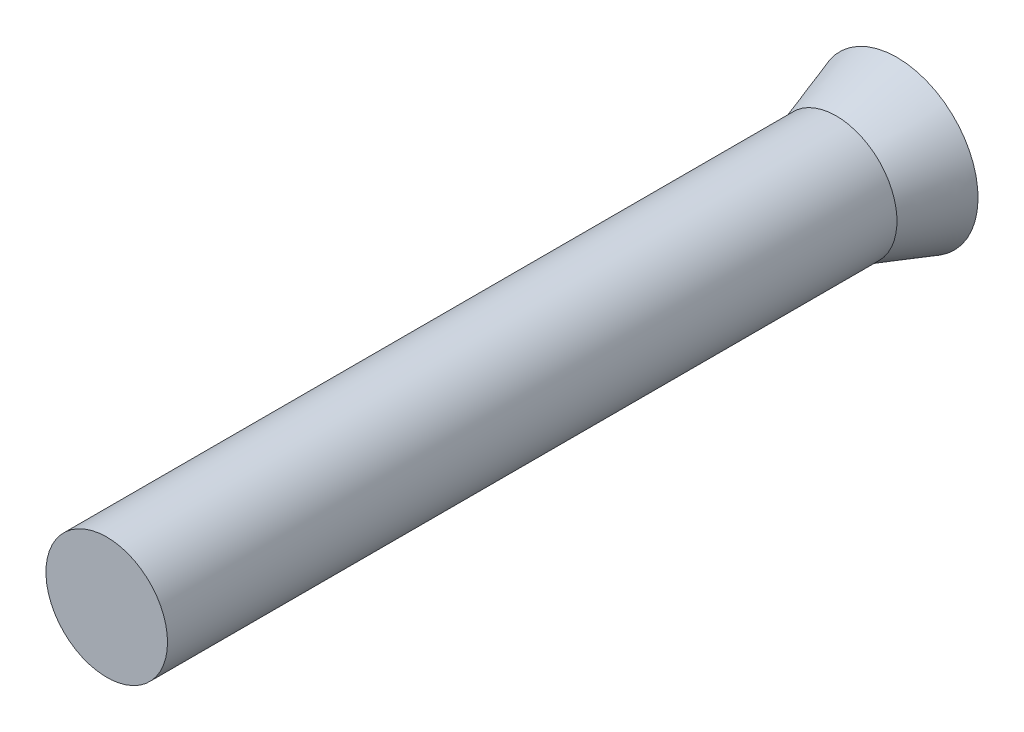
ISO-10303-21;
HEADER;
FILE_DESCRIPTION(('STEP AP214'),'2;1');
FILE_NAME('part.step','',(''),(''),'','','');
FILE_SCHEMA(('AUTOMOTIVE_DESIGN { 1 0 10303 214 1 1 1 1 }'));
ENDSEC;
DATA;
#1=APPLICATION_CONTEXT('core data for automotive mechanical design processes');
#2=APPLICATION_PROTOCOL_DEFINITION('international standard','automotive_design',2000,#1);
#3=PRODUCT_CONTEXT('',#1,'mechanical');
#4=PRODUCT('Part','Part','',(#3));
#5=PRODUCT_RELATED_PRODUCT_CATEGORY('part','',(#4));
#6=PRODUCT_DEFINITION_FORMATION('','',#4);
#7=PRODUCT_DEFINITION_CONTEXT('part definition',#1,'design');
#8=PRODUCT_DEFINITION('design','',#6,#7);
#9=PRODUCT_DEFINITION_SHAPE('','',#8);
#10=(LENGTH_UNIT() NAMED_UNIT(*) SI_UNIT(.MILLI.,.METRE.));
#11=(NAMED_UNIT(*) PLANE_ANGLE_UNIT() SI_UNIT($,.RADIAN.));
#12=(NAMED_UNIT(*) SI_UNIT($,.STERADIAN.) SOLID_ANGLE_UNIT());
#13=UNCERTAINTY_MEASURE_WITH_UNIT(LENGTH_MEASURE(1.E-05),#10,'distance_accuracy_value','');
#14=(GEOMETRIC_REPRESENTATION_CONTEXT(3) GLOBAL_UNCERTAINTY_ASSIGNED_CONTEXT((#13)) GLOBAL_UNIT_ASSIGNED_CONTEXT((#10,
#11,#12)) REPRESENTATION_CONTEXT('',''));
#15=CARTESIAN_POINT('',(0.,0.,0.));
#16=DIRECTION('',(0.,0.,1.));
#17=DIRECTION('',(1.,0.,0.));
#18=AXIS2_PLACEMENT_3D('',#15,#16,#17);
#19=CARTESIAN_POINT('',(0.,0.,18.));
#20=DIRECTION('',(0.,0.,-1.));
#21=DIRECTION('',(-1.,0.,0.));
#22=AXIS2_PLACEMENT_3D('',#19,#20,#21);
#23=CYLINDRICAL_SURFACE('',#22,1.5);
#24=CARTESIAN_POINT('',(0.,0.,18.));
#25=DIRECTION('',(0.,0.,1.));
#26=DIRECTION('',(1.,0.,0.));
#27=AXIS2_PLACEMENT_3D('',#24,#25,#26);
#28=CIRCLE('',#27,1.5);
#29=CARTESIAN_POINT('',(1.5,0.,18.));
#30=VERTEX_POINT('',#29);
#31=EDGE_CURVE('E12',#30,#30,#28,.T.);
#32=ORIENTED_EDGE('',*,*,#31,.F.);
#33=EDGE_LOOP('',(#32));
#34=FACE_BOUND('',#33,.T.);
#35=CARTESIAN_POINT('',(0.,-1.5,0.));
#36=CARTESIAN_POINT('',(0.0842519450187934,-1.49999629268601,-5.66985379244915E-06));
#37=CARTESIAN_POINT('',(0.168564444211541,-1.49287787879634,0.000365308123264373));
#38=CARTESIAN_POINT('',(0.334867768533387,-1.46457981920111,0.000836581424536335));
#39=CARTESIAN_POINT('',(0.416855692078239,-1.44338334273541,0.00093655202318448));
#40=CARTESIAN_POINT('',(0.576076235274264,-1.38753279735842,0.000753833424497418));
#41=CARTESIAN_POINT('',(0.653311099942442,-1.35288513926213,0.000471326356205339));
#42=CARTESIAN_POINT('',(0.800846595613885,-1.2711242731397,-0.000147421754774573));
#43=CARTESIAN_POINT('',(0.871148915554132,-1.22401411163428,-0.000483649657193848));
#44=CARTESIAN_POINT('',(1.00285778790358,-1.11865506593317,-0.000877120102106436));
#45=CARTESIAN_POINT('',(1.06426322407774,-1.06040478618146,-0.000934327667063502));
#46=CARTESIAN_POINT('',(1.17642573598496,-0.934416755746978,-0.000716788084507279));
#47=CARTESIAN_POINT('',(1.2271823613806,-0.866678604024741,-0.000442026901379876));
#48=CARTESIAN_POINT('',(1.31659479512697,-0.723666571328241,0.000177044347242462));
#49=CARTESIAN_POINT('',(1.35525252494135,-0.648393889445022,0.00052134335491251));
#50=CARTESIAN_POINT('',(1.41938850955317,-0.492380904195303,0.000897164672195371));
#51=CARTESIAN_POINT('',(1.4448668294583,-0.411640627841535,0.000928688526965004));
#52=CARTESIAN_POINT('',(1.47264542503769,-0.288273704213918,0.00071089356242822));
#53=CARTESIAN_POINT('',(1.48016619163183,-0.246755794227822,0.000594000856249374));
#54=CARTESIAN_POINT('',(1.49168798340338,-0.163223183688516,0.000331435967917453));
#55=CARTESIAN_POINT('',(1.49568901335044,-0.121208483808591,0.000185763824764129));
#56=CARTESIAN_POINT('',(1.5001367550418,-0.0369938089600322,1.18401374246519E-05));
#57=CARTESIAN_POINT('',(1.50058346774289,0.00520616595872551,-1.64114383696328E-05));
#58=CARTESIAN_POINT('',(1.49792148357119,0.0894936595165266,9.33486674421609E-05));
#59=CARTESIAN_POINT('',(1.49481277675074,0.131581177840599,0.000231360814234968));
#60=CARTESIAN_POINT('',(1.48505978930218,0.215347474881882,0.000497747167122567));
#61=CARTESIAN_POINT('',(1.47841549781643,0.257026252343464,0.000626121343618142));
#62=CARTESIAN_POINT('',(1.46164547846172,0.339665842252601,0.000813265458278116));
#63=CARTESIAN_POINT('',(1.4515197587534,0.380626656382858,0.000872035559596251));
#64=CARTESIAN_POINT('',(1.41601102648118,0.501997431533745,0.000897814342667896));
#65=CARTESIAN_POINT('',(1.38548760101054,0.580971045115754,0.000714663126134933));
#66=CARTESIAN_POINT('',(1.31163358393247,0.732626044111436,0.000167929814348233));
#67=CARTESIAN_POINT('',(1.26830355413338,0.805307705363717,-0.000195644366470044));
#68=CARTESIAN_POINT('',(1.17005497574134,0.942378673773438,-0.000725575841958143));
#69=CARTESIAN_POINT('',(1.11513647538684,1.00676801544689,-0.000891933957545281));
#70=CARTESIAN_POINT('',(0.995260974478712,1.12541926612734,-0.000872266593892782));
#71=CARTESIAN_POINT('',(0.930302746369447,1.17967993490987,-0.000686197992150772));
#72=CARTESIAN_POINT('',(0.792211608420076,1.27652532882067,-0.000135768619707571));
#73=CARTESIAN_POINT('',(0.719078665376766,1.31911000652221,0.000228592875185369));
#74=CARTESIAN_POINT('',(0.566654625235743,1.39140468726879,0.000753685751910439));
#75=CARTESIAN_POINT('',(0.487363482860018,1.42111459564184,0.000914415636395601));
#76=CARTESIAN_POINT('',(0.365622214804256,1.45537176382017,0.000855302610647837));
#77=CARTESIAN_POINT('',(0.324555491989972,1.4650748884395,0.000785465765891648));
#78=CARTESIAN_POINT('',(0.241739981327624,1.48099188556433,0.00058196157793586));
#79=CARTESIAN_POINT('',(0.199991192154716,1.48720575129149,0.000448294110737819));
#80=CARTESIAN_POINT('',(0.116126048356651,1.49609274032374,0.000185113539845742));
#81=CARTESIAN_POINT('',(0.0740097370035205,1.49876627495306,5.55999552499711E-05));
#82=CARTESIAN_POINT('',(-0.0102985522814345,1.5005571295736,-1.93718636308661E-05));
#83=CARTESIAN_POINT('',(-0.052490530057964,1.49967445685515,3.51695247666945E-05));
#84=CARTESIAN_POINT('',(-0.136652436086671,1.49435709581125,0.000235805152922656));
#85=CARTESIAN_POINT('',(-0.178622364754441,1.48992241413621,0.000381899221267249));
#86=CARTESIAN_POINT('',(-0.262029147828474,1.47753883151835,0.000637151099936902));
#87=CARTESIAN_POINT('',(-0.303466001915583,1.46958992847166,0.000746308888149101));
#88=CARTESIAN_POINT('',(-0.426539861885272,1.44053884935304,0.000935303292584019));
#89=CARTESIAN_POINT('',(-0.507014165484813,1.41422755996392,0.00087709077047054));
#90=CARTESIAN_POINT('',(-0.662359004774064,1.3484824119193,0.000467506811596569));
#91=CARTESIAN_POINT('',(-0.737229523711537,1.30904851403633,0.000116134498487586));
#92=CARTESIAN_POINT('',(-0.879302278632581,1.21816832111457,-0.000494583369545773));
#93=CARTESIAN_POINT('',(-0.946504394528209,1.16672183799594,-0.000753927483433682));
#94=CARTESIAN_POINT('',(-1.07131590624554,1.05327843988186,-0.000933871933222788));
#95=CARTESIAN_POINT('',(-1.12892532858728,0.991281554055098,-0.000854473205631));
#96=CARTESIAN_POINT('',(-1.23291825109196,0.858500839939793,-0.000431072893610425));
#97=CARTESIAN_POINT('',(-1.27930216273766,0.787717333877896,-8.70810100507705E-05));
#98=CARTESIAN_POINT('',(-1.35952984406304,0.639365578883252,0.000524373632906013));
#99=CARTESIAN_POINT('',(-1.3933736604977,0.561797355248251,0.000791836677635483));
#100=CARTESIAN_POINT('',(-1.4475661383759,0.402080780445255,0.000928839296813647));
#101=CARTESIAN_POINT('',(-1.46791291636662,0.319931791784674,0.000798323349246778));
#102=CARTESIAN_POINT('',(-1.49452080485025,0.153340273018723,0.000317505276402878));
#103=CARTESIAN_POINT('',(-1.50078186056332,0.0688977339949557,-3.27977036262759E-05));
#104=CARTESIAN_POINT('',(-1.49949029396362,-0.0575678052587795,2.3023405886906E-05));
#105=CARTESIAN_POINT('',(-1.4972761737002,-0.0997070188495425,0.000138674952983263));
#106=CARTESIAN_POINT('',(-1.48931198827303,-0.183649912884209,0.000394868452212738));
#107=CARTESIAN_POINT('',(-1.48356190861257,-0.225453591951779,0.000535410506390135));
#108=CARTESIAN_POINT('',(-1.46104836455715,-0.34989938864631,0.000856118945180274));
#109=CARTESIAN_POINT('',(-1.43902074567202,-0.431652369473628,0.00093579756683189));
#110=CARTESIAN_POINT('',(-1.38156354392601,-0.590259694240545,0.000716593175400192));
#111=CARTESIAN_POINT('',(-1.34613348824087,-0.667113865243362,0.000417696805705104));
#112=CARTESIAN_POINT('',(-1.26287328395045,-0.813792500122605,-0.000207640145958622));
#113=CARTESIAN_POINT('',(-1.21504358575966,-0.883617219214562,-0.000534079727135232));
#114=CARTESIAN_POINT('',(-1.10834446293365,-1.01424156769551,-0.000895730864484617));
#115=CARTESIAN_POINT('',(-1.04947548562553,-1.0750415626002,-0.000930954218540612));
#116=CARTESIAN_POINT('',(-0.92234885759293,-1.18591150173554,-0.000677064984124973));
#117=CARTESIAN_POINT('',(-0.854088849793161,-1.23597874403294,-0.000387870838616778));
#118=CARTESIAN_POINT('',(-0.710115914909648,-1.32395552410769,0.000236718288046966));
#119=CARTESIAN_POINT('',(-0.634400471727281,-1.36186093894339,0.000572128881923685));
#120=CARTESIAN_POINT('',(-0.477739620342524,-1.42438105423968,0.000913784729514692));
#121=CARTESIAN_POINT('',(-0.396800605921179,-1.44901167041979,0.000920425032145715));
#122=CARTESIAN_POINT('',(-0.262791808271184,-1.47774716645204,0.000650415212983498));
#123=CARTESIAN_POINT('',(-0.210590728679504,-1.48608150875356,0.000478533919703896));
#124=CARTESIAN_POINT('',(-0.105601030283775,-1.49720908580202,0.000155103362312362));
#125=CARTESIAN_POINT('',(-0.0528124118339318,-1.5000023238893,3.55408594375131E-06));
#126=CARTESIAN_POINT('',(0.,-1.5,0.));
#127=B_SPLINE_CURVE_WITH_KNOTS('',3,(#35,#36,#37,#38,#39,#40,#41,#42,#43,#44,#45,#46,#47,#48,
#49,#50,#51,#52,#53,#54,#55,#56,#57,#58,#59,#60,#61,#62,#63,#64,#65,#66,#67,#68,#69,#70,#71,#72,
#73,#74,#75,#76,#77,#78,#79,#80,#81,#82,#83,#84,#85,#86,#87,#88,#89,#90,#91,#92,#93,#94,#95,#96,
#97,#98,#99,#100,#101,#102,#103,#104,#105,#106,#107,#108,#109,#110,#111,#112,#113,#114,#115,
#116,#117,#118,#119,#120,#121,#122,#123,#124,#125,#126),.UNSPECIFIED.,.T.,.F.,(4,2,2,2,2,2,2,2,
2,2,2,2,2,2,2,2,2,2,2,2,2,2,2,2,2,2,2,2,2,2,2,2,2,2,2,2,2,2,2,2,2,2,2,2,2,4),(0.,
0.252563675126445,0.505429842782412,0.758175642420499,1.01085971409773,1.2635754610257,
1.51630189313068,1.76898816856626,2.02167319569259,2.14813150546223,2.27458964386615,
2.40104774822915,2.52750620640816,2.65396505293847,2.78042360304541,3.03311605947897,
3.28579743228254,3.53847775328922,3.79118899394847,4.04390126108112,4.29661538645057,
4.42308490558556,4.54955467040335,4.67600974036894,4.80246455109858,4.92891912506797,
5.05537377474252,5.30806341920401,5.56075381903847,5.81344817548642,6.06614183332216,
6.3188262270057,6.57150967856114,6.8242283835763,7.07694807142101,7.20341070808331,
7.32987386321988,7.5825747501521,7.83528455294443,8.08798517739053,8.34067556426471,
8.59342949055482,8.84626901181958,9.09880471485998,9.25712159244582,9.41543837459363),.UNSPECIFIED.);
#128=CARTESIAN_POINT('',(0.,1.5,0.));
#129=VERTEX_POINT('',#128);
#130=EDGE_CURVE('E55',#129,#129,#127,.F.);
#131=ORIENTED_EDGE('',*,*,#130,.F.);
#132=EDGE_LOOP('',(#131));
#133=FACE_BOUND('',#132,.T.);
#134=ADVANCED_FACE('F51',(#34,#133),#23,.T.);
#135=CARTESIAN_POINT('',(0.,0.,18.));
#136=DIRECTION('',(0.,0.,1.));
#137=DIRECTION('',(1.,0.,0.));
#138=AXIS2_PLACEMENT_3D('',#135,#136,#137);
#139=PLANE('',#138);
#140=ORIENTED_EDGE('',*,*,#31,.T.);
#141=EDGE_LOOP('',(#140));
#142=FACE_BOUND('',#141,.T.);
#143=ADVANCED_FACE('F86',(#142),#139,.T.);
#144=CARTESIAN_POINT('',(0.,0.,-1.5));
#145=DIRECTION('',(0.,0.,-1.));
#146=DIRECTION('',(-1.,0.,0.));
#147=AXIS2_PLACEMENT_3D('',#144,#145,#146);
#148=PLANE('',#147);
#149=CARTESIAN_POINT('',(0.,0.,-1.5));
#150=DIRECTION('',(0.,0.,-1.));
#151=DIRECTION('',(-1.,0.,0.));
#152=AXIS2_PLACEMENT_3D('',#149,#150,#151);
#153=CIRCLE('',#152,2.);
#154=CARTESIAN_POINT('',(0.,2.,-1.5));
#155=VERTEX_POINT('',#154);
#156=EDGE_CURVE('E66',#155,#155,#153,.T.);
#157=ORIENTED_EDGE('',*,*,#156,.T.);
#158=EDGE_LOOP('',(#157));
#159=FACE_BOUND('',#158,.T.);
#160=ADVANCED_FACE('F77',(#159),#148,.T.);
#161=CARTESIAN_POINT('',(0.,1.495,0.015));
#162=CARTESIAN_POINT('',(0.,1.49666666666667,0.01));
#163=CARTESIAN_POINT('',(0.,1.49833333333333,0.005));
#164=CARTESIAN_POINT('',(0.,1.5,0.));
#165=CARTESIAN_POINT('',(0.,1.66666666666667,-0.5));
#166=CARTESIAN_POINT('',(0.,1.83333333333333,-1.));
#167=CARTESIAN_POINT('',(0.,2.,-1.5));
#168=CARTESIAN_POINT('',(0.0412556469917519,1.495,0.015));
#169=CARTESIAN_POINT('',(0.0413016399092455,1.49666666666667,0.01));
#170=CARTESIAN_POINT('',(0.041347632826739,1.49833333333333,0.005));
#171=CARTESIAN_POINT('',(0.0413936257442326,1.5,0.));
#172=CARTESIAN_POINT('',(0.0459929174935914,1.66666666666667,-0.5));
#173=CARTESIAN_POINT('',(0.0505922092429502,1.83333333333333,-1.));
#174=CARTESIAN_POINT('',(0.055191500992309,2.,-1.5));
#175=CARTESIAN_POINT('',(0.122990811576905,1.49165056469917,0.015));
#176=CARTESIAN_POINT('',(0.12312792507922,1.49331349732426,0.01));
#177=CARTESIAN_POINT('',(0.123265038581535,1.49497642994934,0.005));
#178=CARTESIAN_POINT('',(0.123402152083851,1.49663936257442,0.));
#179=CARTESIAN_POINT('',(0.137113502315389,1.66293262508269,-0.5));
#180=CARTESIAN_POINT('',(0.150824852546928,1.82922588759096,-1.));
#181=CARTESIAN_POINT('',(0.164536202778467,1.99551915009923,-1.5));
#182=CARTESIAN_POINT('',(0.242879174374212,1.47696410173083,0.015));
#183=CARTESIAN_POINT('',(0.243149942684552,1.4786106614875,0.01));
#184=CARTESIAN_POINT('',(0.243420710994891,1.48025722124417,0.005));
#185=CARTESIAN_POINT('',(0.24369147930523,1.48190378100084,0.));
#186=CARTESIAN_POINT('',(0.270768310339144,1.6465597566676,-0.5));
#187=CARTESIAN_POINT('',(0.297845141373058,1.81121573233436,-1.));
#188=CARTESIAN_POINT('',(0.324921972406972,1.97587170800112,-1.5));
#189=CARTESIAN_POINT('',(0.359667157205727,1.45300132463076,0.015));
#190=CARTESIAN_POINT('',(0.360068123936168,1.45462117003169,0.01));
#191=CARTESIAN_POINT('',(0.360469090666609,1.45624101543261,0.005));
#192=CARTESIAN_POINT('',(0.36087005739705,1.45786086083354,0.));
#193=CARTESIAN_POINT('',(0.400966730441167,1.61984540092616,-0.5));
#194=CARTESIAN_POINT('',(0.441063403485283,1.78182994101877,-1.));
#195=CARTESIAN_POINT('',(0.481160076529399,1.94381448111139,-1.5));
#196=CARTESIAN_POINT('',(1.03947679908782,1.25588275255216,0.015));
#197=CARTESIAN_POINT('',(1.04063563609907,1.25728284480696,0.01));
#198=CARTESIAN_POINT('',(1.04179447311032,1.25868293706175,0.005));
#199=CARTESIAN_POINT('',(1.04295331012156,1.26008302931655,0.));
#200=CARTESIAN_POINT('',(1.15883701124618,1.40009225479616,-0.5));
#201=CARTESIAN_POINT('',(1.2747207123708,1.54010148027578,-1.));
#202=CARTESIAN_POINT('',(1.39060441349542,1.6801107057554,-1.5));
#203=CARTESIAN_POINT('',(1.495,0.660090351868027,0.015));
#204=CARTESIAN_POINT('',(1.49666666666667,0.660826238547925,0.01));
#205=CARTESIAN_POINT('',(1.49833333333333,0.661562125227822,0.005));
#206=CARTESIAN_POINT('',(1.5,0.66229801190772,0.));
#207=CARTESIAN_POINT('',(1.66666666666667,0.735886679897467,-0.5));
#208=CARTESIAN_POINT('',(1.83333333333333,0.809475347887214,-1.));
#209=CARTESIAN_POINT('',(2.,0.883064015876961,-1.5));
#210=CARTESIAN_POINT('',(1.495,-0.825112939835035,0.015));
#211=CARTESIAN_POINT('',(1.49666666666667,-0.826032798184907,0.01));
#212=CARTESIAN_POINT('',(1.49833333333333,-0.826952656534779,0.005));
#213=CARTESIAN_POINT('',(1.5,-0.827872514884651,0.));
#214=CARTESIAN_POINT('',(1.66666666666667,-0.919858349871833,-0.5));
#215=CARTESIAN_POINT('',(1.83333333333333,-1.01184418485902,-1.));
#216=CARTESIAN_POINT('',(2.,-1.1038300198462,-1.5));
#217=CARTESIAN_POINT('',(0.825112939835034,-1.495,0.015));
#218=CARTESIAN_POINT('',(0.826032798184906,-1.49666666666667,0.01));
#219=CARTESIAN_POINT('',(0.826952656534778,-1.49833333333333,0.005));
#220=CARTESIAN_POINT('',(0.82787251488465,-1.5,0.));
#221=CARTESIAN_POINT('',(0.919858349871833,-1.66666666666667,-0.5));
#222=CARTESIAN_POINT('',(1.01184418485902,-1.83333333333333,-1.));
#223=CARTESIAN_POINT('',(1.1038300198462,-2.,-1.5));
#224=CARTESIAN_POINT('',(-0.825112939835035,-1.495,0.015));
#225=CARTESIAN_POINT('',(-0.826032798184907,-1.49666666666667,0.01));
#226=CARTESIAN_POINT('',(-0.826952656534779,-1.49833333333333,0.005));
#227=CARTESIAN_POINT('',(-0.82787251488465,-1.5,0.));
#228=CARTESIAN_POINT('',(-0.919858349871833,-1.66666666666667,-0.5));
#229=CARTESIAN_POINT('',(-1.01184418485902,-1.83333333333333,-1.));
#230=CARTESIAN_POINT('',(-1.1038300198462,-2.,-1.5));
#231=CARTESIAN_POINT('',(-1.495,-0.825112939835035,0.015));
#232=CARTESIAN_POINT('',(-1.49666666666667,-0.826032798184906,0.01));
#233=CARTESIAN_POINT('',(-1.49833333333333,-0.826952656534778,0.005));
#234=CARTESIAN_POINT('',(-1.5,-0.82787251488465,0.));
#235=CARTESIAN_POINT('',(-1.66666666666667,-0.919858349871834,-0.5));
#236=CARTESIAN_POINT('',(-1.83333333333333,-1.01184418485902,-1.));
#237=CARTESIAN_POINT('',(-2.,-1.1038300198462,-1.5));
#238=CARTESIAN_POINT('',(-1.495,0.660090351868028,0.015));
#239=CARTESIAN_POINT('',(-1.49666666666667,0.660826238547925,0.01));
#240=CARTESIAN_POINT('',(-1.49833333333333,0.661562125227823,0.005));
#241=CARTESIAN_POINT('',(-1.5,0.66229801190772,0.));
#242=CARTESIAN_POINT('',(-1.66666666666667,0.735886679897467,-0.5));
#243=CARTESIAN_POINT('',(-1.83333333333333,0.809475347887213,-1.));
#244=CARTESIAN_POINT('',(-2.,0.883064015876959,-1.5));
#245=CARTESIAN_POINT('',(-1.03947679908782,1.25588275255216,0.015));
#246=CARTESIAN_POINT('',(-1.04063563609907,1.25728284480696,0.01));
#247=CARTESIAN_POINT('',(-1.04179447311032,1.25868293706175,0.005));
#248=CARTESIAN_POINT('',(-1.04295331012156,1.26008302931655,0.));
#249=CARTESIAN_POINT('',(-1.15883701124618,1.40009225479616,-0.5));
#250=CARTESIAN_POINT('',(-1.2747207123708,1.54010148027578,-1.));
#251=CARTESIAN_POINT('',(-1.39060441349542,1.6801107057554,-1.5));
#252=CARTESIAN_POINT('',(-0.359667157205726,1.45300132463076,0.015));
#253=CARTESIAN_POINT('',(-0.360068123936168,1.45462117003169,0.01));
#254=CARTESIAN_POINT('',(-0.360469090666609,1.45624101543261,0.005));
#255=CARTESIAN_POINT('',(-0.36087005739705,1.45786086083354,0.));
#256=CARTESIAN_POINT('',(-0.400966730441167,1.61984540092616,-0.5));
#257=CARTESIAN_POINT('',(-0.441063403485284,1.78182994101877,-1.));
#258=CARTESIAN_POINT('',(-0.481160076529401,1.94381448111139,-1.5));
#259=CARTESIAN_POINT('',(-0.242879174374212,1.47696410173083,0.015));
#260=CARTESIAN_POINT('',(-0.243149942684551,1.4786106614875,0.01));
#261=CARTESIAN_POINT('',(-0.24342071099489,1.48025722124417,0.005));
#262=CARTESIAN_POINT('',(-0.243691479305229,1.48190378100084,0.));
#263=CARTESIAN_POINT('',(-0.270768310339144,1.6465597566676,-0.5));
#264=CARTESIAN_POINT('',(-0.297845141373059,1.81121573233436,-1.));
#265=CARTESIAN_POINT('',(-0.324921972406974,1.97587170800112,-1.5));
#266=CARTESIAN_POINT('',(-0.122990811576905,1.49165056469917,0.015));
#267=CARTESIAN_POINT('',(-0.12312792507922,1.49331349732426,0.01));
#268=CARTESIAN_POINT('',(-0.123265038581535,1.49497642994934,0.005));
#269=CARTESIAN_POINT('',(-0.123402152083851,1.49663936257442,0.));
#270=CARTESIAN_POINT('',(-0.13711350231539,1.66293262508269,-0.5));
#271=CARTESIAN_POINT('',(-0.150824852546929,1.82922588759096,-1.));
#272=CARTESIAN_POINT('',(-0.164536202778469,1.99551915009923,-1.5));
#273=CARTESIAN_POINT('',(-0.0412556469917513,1.495,0.015));
#274=CARTESIAN_POINT('',(-0.0413016399092449,1.49666666666667,0.01));
#275=CARTESIAN_POINT('',(-0.0413476328267385,1.49833333333333,0.005));
#276=CARTESIAN_POINT('',(-0.0413936257442321,1.5,0.));
#277=CARTESIAN_POINT('',(-0.0459929174935916,1.66666666666667,-0.5));
#278=CARTESIAN_POINT('',(-0.0505922092429511,1.83333333333333,-1.));
#279=CARTESIAN_POINT('',(-0.0551915009923106,2.,-1.5));
#280=CARTESIAN_POINT('',(0.,1.495,0.015));
#281=CARTESIAN_POINT('',(0.,1.49666666666667,0.01));
#282=CARTESIAN_POINT('',(0.,1.49833333333333,0.005));
#283=CARTESIAN_POINT('',(0.,1.5,0.));
#284=CARTESIAN_POINT('',(0.,1.66666666666667,-0.5));
#285=CARTESIAN_POINT('',(0.,1.83333333333333,-1.));
#286=CARTESIAN_POINT('',(0.,2.,-1.5));
#287=B_SPLINE_SURFACE_WITH_KNOTS('',3,3,((#161,#162,#163,#164,#165,#166,#167),(#168,#169,#170,
#171,#172,#173,#174),(#175,#176,#177,#178,#179,#180,#181),(#182,#183,#184,#185,#186,#187,#188),
(#189,#190,#191,#192,#193,#194,#195),(#196,#197,#198,#199,#200,#201,#202),(#203,#204,#205,#206,
#207,#208,#209),(#210,#211,#212,#213,#214,#215,#216),(#217,#218,#219,#220,#221,#222,#223),(#224,
#225,#226,#227,#228,#229,#230),(#231,#232,#233,#234,#235,#236,#237),(#238,#239,#240,#241,#242,
#243,#244),(#245,#246,#247,#248,#249,#250,#251),(#252,#253,#254,#255,#256,#257,#258),(#259,#260,
#261,#262,#263,#264,#265),(#266,#267,#268,#269,#270,#271,#272),(#273,#274,#275,#276,#277,#278,
#279),(#280,#281,#282,#283,#284,#285,#286)),.UNSPECIFIED.,.T.,.F.,.F.,(4,1,1,1,1,2,2,2,1,1,1,1,
4),(4,3,4),(0.,0.0125,0.0249999999999999,0.0375000000000001,0.05,0.25,0.5,0.75,0.95,0.9625,
0.975,0.9875,1.),(-0.01,0.,1.),.UNSPECIFIED.);
#288=CARTESIAN_POINT('',(0.,1.5,0.));
#289=CARTESIAN_POINT('',(0.,1.50520833333333,-0.0156250000000004));
#290=CARTESIAN_POINT('',(0.,1.51041666666667,-0.0312500000000004));
#291=CARTESIAN_POINT('',(0.,1.52083333333333,-0.0625000000000004));
#292=CARTESIAN_POINT('',(0.,1.52604166666667,-0.0781250000000005));
#293=CARTESIAN_POINT('',(0.,1.53645833333333,-0.109375));
#294=CARTESIAN_POINT('',(0.,1.54166666666667,-0.125));
#295=CARTESIAN_POINT('',(0.,1.55208333333333,-0.15625));
#296=CARTESIAN_POINT('',(0.,1.55729166666667,-0.171875));
#297=CARTESIAN_POINT('',(0.,1.56770833333333,-0.203125));
#298=CARTESIAN_POINT('',(0.,1.57291666666667,-0.21875));
#299=CARTESIAN_POINT('',(0.,1.58333333333333,-0.25));
#300=CARTESIAN_POINT('',(0.,1.58854166666667,-0.265625));
#301=CARTESIAN_POINT('',(0.,1.59895833333333,-0.296875));
#302=CARTESIAN_POINT('',(0.,1.60416666666667,-0.3125));
#303=CARTESIAN_POINT('',(0.,1.61458333333333,-0.34375));
#304=CARTESIAN_POINT('',(0.,1.61979166666667,-0.359375));
#305=CARTESIAN_POINT('',(0.,1.63020833333333,-0.390625));
#306=CARTESIAN_POINT('',(0.,1.63541666666667,-0.40625));
#307=CARTESIAN_POINT('',(0.,1.64583333333333,-0.4375));
#308=CARTESIAN_POINT('',(0.,1.65104166666667,-0.453125));
#309=CARTESIAN_POINT('',(0.,1.66145833333333,-0.484375));
#310=CARTESIAN_POINT('',(0.,1.66666666666667,-0.5));
#311=CARTESIAN_POINT('',(0.,1.67708333333333,-0.53125));
#312=CARTESIAN_POINT('',(0.,1.68229166666667,-0.546875));
#313=CARTESIAN_POINT('',(0.,1.69270833333333,-0.578125));
#314=CARTESIAN_POINT('',(0.,1.69791666666667,-0.59375));
#315=CARTESIAN_POINT('',(0.,1.70833333333333,-0.625));
#316=CARTESIAN_POINT('',(0.,1.71354166666667,-0.640625));
#317=CARTESIAN_POINT('',(0.,1.72395833333333,-0.671875));
#318=CARTESIAN_POINT('',(0.,1.72916666666667,-0.6875));
#319=CARTESIAN_POINT('',(0.,1.73958333333333,-0.71875));
#320=CARTESIAN_POINT('',(0.,1.74479166666667,-0.734375));
#321=CARTESIAN_POINT('',(0.,1.75520833333333,-0.765625));
#322=CARTESIAN_POINT('',(0.,1.76041666666667,-0.78125));
#323=CARTESIAN_POINT('',(0.,1.77083333333333,-0.8125));
#324=CARTESIAN_POINT('',(0.,1.77604166666667,-0.828125));
#325=CARTESIAN_POINT('',(0.,1.78645833333333,-0.859375));
#326=CARTESIAN_POINT('',(0.,1.79166666666667,-0.875));
#327=CARTESIAN_POINT('',(0.,1.80208333333333,-0.90625));
#328=CARTESIAN_POINT('',(0.,1.80729166666667,-0.921875));
#329=CARTESIAN_POINT('',(0.,1.81770833333333,-0.953125));
#330=CARTESIAN_POINT('',(0.,1.82291666666667,-0.96875));
#331=CARTESIAN_POINT('',(0.,1.83333333333333,-1.));
#332=CARTESIAN_POINT('',(0.,1.83854166666667,-1.015625));
#333=CARTESIAN_POINT('',(0.,1.84895833333333,-1.046875));
#334=CARTESIAN_POINT('',(0.,1.85416666666667,-1.0625));
#335=CARTESIAN_POINT('',(0.,1.86458333333333,-1.09375));
#336=CARTESIAN_POINT('',(0.,1.86979166666667,-1.109375));
#337=CARTESIAN_POINT('',(0.,1.88020833333333,-1.140625));
#338=CARTESIAN_POINT('',(0.,1.88541666666667,-1.15625));
#339=CARTESIAN_POINT('',(0.,1.89583333333333,-1.1875));
#340=CARTESIAN_POINT('',(0.,1.90104166666667,-1.203125));
#341=CARTESIAN_POINT('',(0.,1.91145833333333,-1.234375));
#342=CARTESIAN_POINT('',(0.,1.91666666666667,-1.25));
#343=CARTESIAN_POINT('',(0.,1.92708333333333,-1.28125));
#344=CARTESIAN_POINT('',(0.,1.93229166666667,-1.296875));
#345=CARTESIAN_POINT('',(0.,1.94270833333333,-1.328125));
#346=CARTESIAN_POINT('',(0.,1.94791666666667,-1.34375));
#347=CARTESIAN_POINT('',(0.,1.95833333333333,-1.375));
#348=CARTESIAN_POINT('',(0.,1.96354166666667,-1.390625));
#349=CARTESIAN_POINT('',(0.,1.97395833333333,-1.421875));
#350=CARTESIAN_POINT('',(0.,1.97916666666667,-1.4375));
#351=CARTESIAN_POINT('',(0.,1.98958333333333,-1.46875));
#352=CARTESIAN_POINT('',(0.,1.99479166666667,-1.484375));
#353=CARTESIAN_POINT('',(0.,2.,-1.5));
#354=B_SPLINE_CURVE_WITH_KNOTS('',3,(#288,#289,#290,#291,#292,#293,#294,#295,#296,#297,#298,
#299,#300,#301,#302,#303,#304,#305,#306,#307,#308,#309,#310,#311,#312,#313,#314,#315,#316,#317,
#318,#319,#320,#321,#322,#323,#324,#325,#326,#327,#328,#329,#330,#331,#332,#333,#334,#335,#336,
#337,#338,#339,#340,#341,#342,#343,#344,#345,#346,#347,#348,#349,#350,#351,#352,#353),
.UNSPECIFIED.,.F.,.F.,(4,2,2,2,2,2,2,2,2,2,2,2,2,2,2,2,2,2,2,2,2,2,2,2,2,2,2,2,2,2,2,2,4),(0.,
0.049410588440131,0.0988211768802618,0.148231765320393,0.197642353760524,0.247052942200655,
0.296463530640786,0.345874119080916,0.395284707521047,0.444695295961178,0.494105884401309,
0.54351647284144,0.592927061281571,0.642337649721702,0.691748238161833,0.741158826601964,
0.790569415042095,0.839980003482225,0.889390591922356,0.938801180362487,0.988211768802618,
1.03762235724275,1.08703294568288,1.13644353412301,1.18585412256314,1.23526471100327,
1.2846752994434,1.33408588788353,1.38349647632367,1.4329070647638,1.48231765320393,
1.53172824164406,1.58113883008419),.UNSPECIFIED.);
#355=EDGE_CURVE('BSEAM85',#129,#155,#354,.T.);
#356=ORIENTED_EDGE('',*,*,#130,.T.);
#357=ORIENTED_EDGE('',*,*,#156,.F.);
#358=ORIENTED_EDGE('',*,*,#355,.T.);
#359=ORIENTED_EDGE('',*,*,#355,.F.);
#360=EDGE_LOOP('',(#356,#358,#357,#359));
#361=FACE_BOUND('',#360,.T.);
#362=ADVANCED_FACE('F85',(#361),#287,.T.);
#363=CLOSED_SHELL('',(#134,#143,#160,#362));
#364=MANIFOLD_SOLID_BREP('B2',#363);
#365=ADVANCED_BREP_SHAPE_REPRESENTATION('',(#18,#364),#14);
#366=SHAPE_DEFINITION_REPRESENTATION(#9,#365);
ENDSEC;
END-ISO-10303-21;
